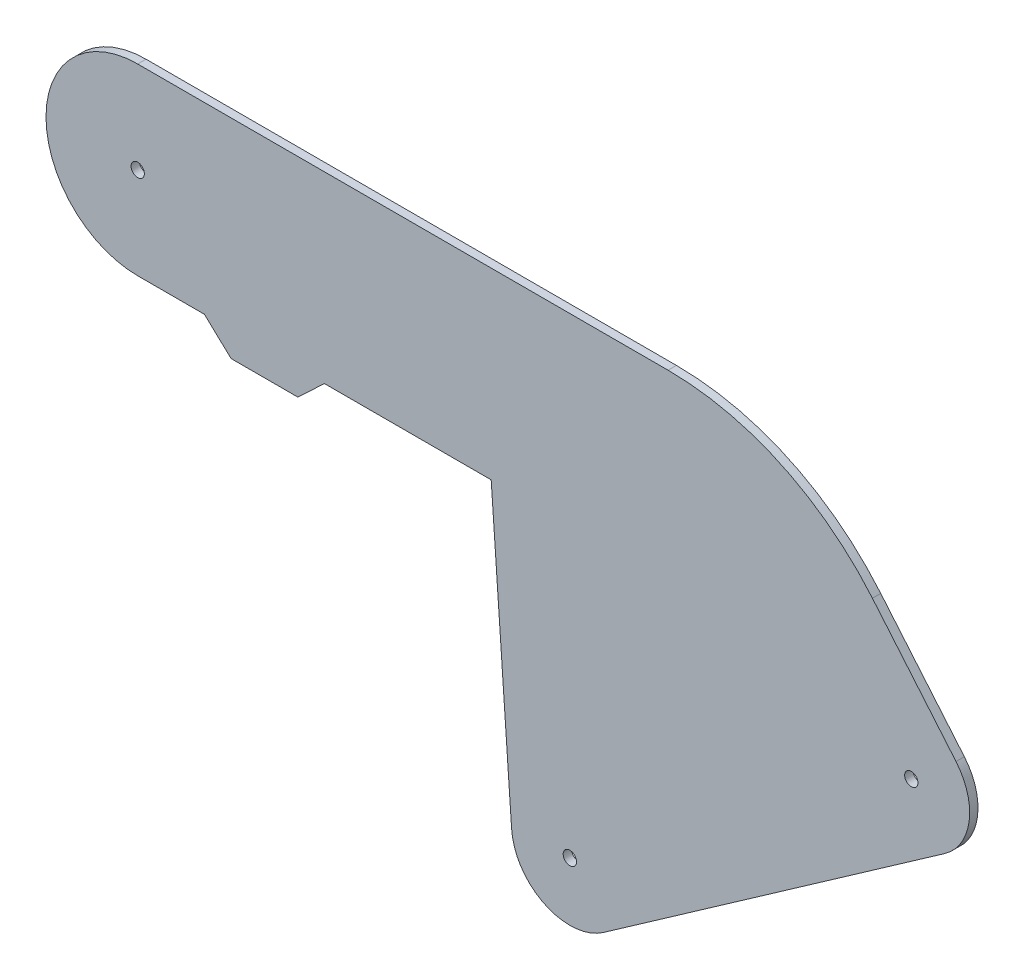
ISO-10303-21;
HEADER;
FILE_DESCRIPTION(('STEP AP214'),'2;1');
FILE_NAME('part.step','',(''),(''),'','','');
FILE_SCHEMA(('AUTOMOTIVE_DESIGN { 1 0 10303 214 1 1 1 1 }'));
ENDSEC;
DATA;
#1=APPLICATION_CONTEXT('core data for automotive mechanical design processes');
#2=APPLICATION_PROTOCOL_DEFINITION('international standard','automotive_design',2000,#1);
#3=PRODUCT_CONTEXT('',#1,'mechanical');
#4=PRODUCT('Part','Part','',(#3));
#5=PRODUCT_RELATED_PRODUCT_CATEGORY('part','',(#4));
#6=PRODUCT_DEFINITION_FORMATION('','',#4);
#7=PRODUCT_DEFINITION_CONTEXT('part definition',#1,'design');
#8=PRODUCT_DEFINITION('design','',#6,#7);
#9=PRODUCT_DEFINITION_SHAPE('','',#8);
#10=(LENGTH_UNIT() NAMED_UNIT(*) SI_UNIT(.MILLI.,.METRE.));
#11=(NAMED_UNIT(*) PLANE_ANGLE_UNIT() SI_UNIT($,.RADIAN.));
#12=(NAMED_UNIT(*) SI_UNIT($,.STERADIAN.) SOLID_ANGLE_UNIT());
#13=UNCERTAINTY_MEASURE_WITH_UNIT(LENGTH_MEASURE(1.E-05),#10,'distance_accuracy_value','');
#14=(GEOMETRIC_REPRESENTATION_CONTEXT(3) GLOBAL_UNCERTAINTY_ASSIGNED_CONTEXT((#13)) GLOBAL_UNIT_ASSIGNED_CONTEXT((#10,
#11,#12)) REPRESENTATION_CONTEXT('',''));
#15=CARTESIAN_POINT('',(0.,0.,0.));
#16=DIRECTION('',(0.,0.,1.));
#17=DIRECTION('',(1.,0.,0.));
#18=AXIS2_PLACEMENT_3D('',#15,#16,#17);
#19=CARTESIAN_POINT('',(164.572072720799,71.2488259804571,3.175));
#20=DIRECTION('',(0.,0.,1.));
#21=DIRECTION('',(1.,0.,0.));
#22=AXIS2_PLACEMENT_3D('',#19,#20,#21);
#23=PLANE('',#22);
#24=CARTESIAN_POINT('',(0.,215.9,3.175));
#25=DIRECTION('',(0.,0.,1.));
#26=DIRECTION('',(1.,0.,0.));
#27=AXIS2_PLACEMENT_3D('',#24,#25,#26);
#28=CIRCLE('',#27,2.54000000000001);
#29=CARTESIAN_POINT('',(2.54000000000001,215.9,3.175));
#30=VERTEX_POINT('',#29);
#31=EDGE_CURVE('E349',#30,#30,#28,.T.);
#32=ORIENTED_EDGE('',*,*,#31,.F.);
#33=EDGE_LOOP('',(#32));
#34=FACE_BOUND('',#33,.T.);
#35=CARTESIAN_POINT('',(164.572072720799,71.2488259804571,3.175));
#36=DIRECTION('',(0.,0.,1.));
#37=DIRECTION('',(1.,0.,0.));
#38=AXIS2_PLACEMENT_3D('',#35,#36,#37);
#39=CIRCLE('',#38,22.225);
#40=CARTESIAN_POINT('',(142.401211703775,69.698488351494,3.175));
#41=VERTEX_POINT('',#40);
#42=CARTESIAN_POINT('',(177.319809018701,53.0431717961343,3.175));
#43=VERTEX_POINT('',#42);
#44=EDGE_CURVE('E215',#41,#43,#39,.T.);
#45=ORIENTED_EDGE('',*,*,#44,.T.);
#46=DIRECTION('',(0.819152044288991,0.573576436351047,0.));
#47=VECTOR('',#46,1.);
#48=CARTESIAN_POINT('',(177.319809018701,53.0431717961343,3.175));
#49=LINE('',#48,#47);
#50=CARTESIAN_POINT('',(307.360196049579,144.098431066863,3.175));
#51=VERTEX_POINT('',#50);
#52=EDGE_CURVE('E121',#43,#51,#49,.T.);
#53=ORIENTED_EDGE('',*,*,#52,.T.);
#54=CARTESIAN_POINT('',(294.612459751677,162.304085251186,3.175));
#55=DIRECTION('',(0.,0.,1.));
#56=DIRECTION('',(-1.,0.,0.));
#57=AXIS2_PLACEMENT_3D('',#54,#55,#56);
#58=CIRCLE('',#57,22.225);
#59=CARTESIAN_POINT('',(311.637797499996,176.590039876469,3.175));
#60=VERTEX_POINT('',#59);
#61=EDGE_CURVE('E256',#51,#60,#58,.T.);
#62=ORIENTED_EDGE('',*,*,#61,.T.);
#63=DIRECTION('',(-0.642787609686537,0.76604444311898,0.));
#64=VECTOR('',#63,1.);
#65=CARTESIAN_POINT('',(279.800527192222,214.532221144152,3.175));
#66=LINE('',#65,#64);
#67=CARTESIAN_POINT('',(279.800527192222,214.532221144152,3.175));
#68=VERTEX_POINT('',#67);
#69=EDGE_CURVE('E276',#60,#68,#66,.T.);
#70=ORIENTED_EDGE('',*,*,#69,.T.);
#71=CARTESIAN_POINT('',(201.970411771333,149.225,3.175));
#72=DIRECTION('',(0.,0.,1.));
#73=DIRECTION('',(-1.,0.,0.));
#74=AXIS2_PLACEMENT_3D('',#71,#72,#73);
#75=CIRCLE('',#74,101.6);
#76=CARTESIAN_POINT('',(201.970411771333,250.825,3.175));
#77=VERTEX_POINT('',#76);
#78=EDGE_CURVE('E272',#68,#77,#75,.T.);
#79=ORIENTED_EDGE('',*,*,#78,.T.);
#80=DIRECTION('',(-1.,0.,0.));
#81=VECTOR('',#80,1.);
#82=CARTESIAN_POINT('',(0.,250.825,3.175));
#83=LINE('',#82,#81);
#84=CARTESIAN_POINT('',(0.,250.825,3.175));
#85=VERTEX_POINT('',#84);
#86=EDGE_CURVE('E275',#77,#85,#83,.T.);
#87=ORIENTED_EDGE('',*,*,#86,.T.);
#88=CARTESIAN_POINT('',(0.,215.9,3.175));
#89=DIRECTION('',(0.,0.,1.));
#90=DIRECTION('',(1.,0.,0.));
#91=AXIS2_PLACEMENT_3D('',#88,#89,#90);
#92=CIRCLE('',#91,34.925);
#93=CARTESIAN_POINT('',(0.,180.975,3.175));
#94=VERTEX_POINT('',#93);
#95=EDGE_CURVE('E280',#85,#94,#92,.T.);
#96=ORIENTED_EDGE('',*,*,#95,.T.);
#97=DIRECTION('',(1.,0.,0.));
#98=VECTOR('',#97,1.);
#99=CARTESIAN_POINT('',(0.,180.975,3.175));
#100=LINE('',#99,#98);
#101=CARTESIAN_POINT('',(25.4,180.975,3.175));
#102=VERTEX_POINT('',#101);
#103=EDGE_CURVE('E287',#94,#102,#100,.T.);
#104=ORIENTED_EDGE('',*,*,#103,.T.);
#105=DIRECTION('',(0.729537204140085,-0.68394112888133,0.));
#106=VECTOR('',#105,1.);
#107=CARTESIAN_POINT('',(25.4,180.975,3.175));
#108=LINE('',#107,#106);
#109=CARTESIAN_POINT('',(35.56,171.45,3.175));
#110=VERTEX_POINT('',#109);
#111=EDGE_CURVE('E290',#102,#110,#108,.T.);
#112=ORIENTED_EDGE('',*,*,#111,.T.);
#113=DIRECTION('',(1.,0.,0.));
#114=VECTOR('',#113,1.);
#115=CARTESIAN_POINT('',(35.56,171.45,3.175));
#116=LINE('',#115,#114);
#117=CARTESIAN_POINT('',(60.96,171.45,3.175));
#118=VERTEX_POINT('',#117);
#119=EDGE_CURVE('E155',#110,#118,#116,.T.);
#120=ORIENTED_EDGE('',*,*,#119,.T.);
#121=DIRECTION('',(0.729537204140086,0.683941128881329,0.));
#122=VECTOR('',#121,1.);
#123=CARTESIAN_POINT('',(60.96,171.45,3.175));
#124=LINE('',#123,#122);
#125=CARTESIAN_POINT('',(71.12,180.975,3.175));
#126=VERTEX_POINT('',#125);
#127=EDGE_CURVE('E149',#118,#126,#124,.T.);
#128=ORIENTED_EDGE('',*,*,#127,.T.);
#129=DIRECTION('',(1.,0.,0.));
#130=VECTOR('',#129,1.);
#131=CARTESIAN_POINT('',(71.12,180.975,3.175));
#132=LINE('',#131,#130);
#133=CARTESIAN_POINT('',(134.62,180.975,3.175));
#134=VERTEX_POINT('',#133);
#135=EDGE_CURVE('E153',#126,#134,#132,.T.);
#136=ORIENTED_EDGE('',*,*,#135,.T.);
#137=DIRECTION('',(0.0697564737441218,-0.997564050259824,0.));
#138=VECTOR('',#137,1.);
#139=CARTESIAN_POINT('',(134.62,180.975,3.175));
#140=LINE('',#139,#138);
#141=EDGE_CURVE('E63',#134,#41,#140,.T.);
#142=ORIENTED_EDGE('',*,*,#141,.T.);
#143=EDGE_LOOP('',(#45,#53,#62,#70,#79,#87,#96,#104,#112,#120,#128,#136,#142));
#144=FACE_BOUND('',#143,.T.);
#145=CARTESIAN_POINT('',(164.572072720799,71.2488259804571,3.175));
#146=DIRECTION('',(0.,0.,1.));
#147=DIRECTION('',(1.,0.,0.));
#148=AXIS2_PLACEMENT_3D('',#145,#146,#147);
#149=CIRCLE('',#148,2.5400000000398);
#150=CARTESIAN_POINT('',(167.112072720839,71.2488259804571,3.175));
#151=VERTEX_POINT('',#150);
#152=EDGE_CURVE('E182',#151,#151,#149,.T.);
#153=ORIENTED_EDGE('',*,*,#152,.F.);
#154=EDGE_LOOP('',(#153));
#155=FACE_BOUND('',#154,.T.);
#156=CARTESIAN_POINT('',(294.612459751677,162.304085251186,3.175));
#157=DIRECTION('',(0.,0.,1.));
#158=DIRECTION('',(1.,0.,0.));
#159=AXIS2_PLACEMENT_3D('',#156,#157,#158);
#160=CIRCLE('',#159,2.54000000000186);
#161=CARTESIAN_POINT('',(297.152459751678,162.304085251186,3.175));
#162=VERTEX_POINT('',#161);
#163=EDGE_CURVE('E338',#162,#162,#160,.T.);
#164=ORIENTED_EDGE('',*,*,#163,.F.);
#165=EDGE_LOOP('',(#164));
#166=FACE_BOUND('',#165,.T.);
#167=ADVANCED_FACE('F45',(#34,#144,#155,#166),#23,.T.);
#168=CARTESIAN_POINT('',(164.572072720799,71.2488259804571,0.));
#169=DIRECTION('',(0.,0.,1.));
#170=DIRECTION('',(1.,0.,0.));
#171=AXIS2_PLACEMENT_3D('',#168,#169,#170);
#172=PLANE('',#171);
#173=CARTESIAN_POINT('',(164.572072720799,71.2488259804571,0.));
#174=DIRECTION('',(0.,0.,1.));
#175=DIRECTION('',(1.,0.,0.));
#176=AXIS2_PLACEMENT_3D('',#173,#174,#175);
#177=CIRCLE('',#176,22.225);
#178=CARTESIAN_POINT('',(142.401211703775,69.698488351494,0.));
#179=VERTEX_POINT('',#178);
#180=CARTESIAN_POINT('',(177.319809018701,53.0431717961343,0.));
#181=VERTEX_POINT('',#180);
#182=EDGE_CURVE('E177',#179,#181,#177,.T.);
#183=ORIENTED_EDGE('',*,*,#182,.F.);
#184=DIRECTION('',(0.0697564737441218,-0.997564050259824,0.));
#185=VECTOR('',#184,1.);
#186=CARTESIAN_POINT('',(134.62,180.975,0.));
#187=LINE('',#186,#185);
#188=CARTESIAN_POINT('',(134.62,180.975,0.));
#189=VERTEX_POINT('',#188);
#190=EDGE_CURVE('E113',#189,#179,#187,.T.);
#191=ORIENTED_EDGE('',*,*,#190,.F.);
#192=DIRECTION('',(1.,0.,0.));
#193=VECTOR('',#192,1.);
#194=CARTESIAN_POINT('',(71.12,180.975,0.));
#195=LINE('',#194,#193);
#196=CARTESIAN_POINT('',(71.12,180.975,0.));
#197=VERTEX_POINT('',#196);
#198=EDGE_CURVE('E107',#197,#189,#195,.T.);
#199=ORIENTED_EDGE('',*,*,#198,.F.);
#200=DIRECTION('',(0.729537204140086,0.683941128881329,0.));
#201=VECTOR('',#200,1.);
#202=CARTESIAN_POINT('',(60.96,171.45,0.));
#203=LINE('',#202,#201);
#204=CARTESIAN_POINT('',(60.96,171.45,0.));
#205=VERTEX_POINT('',#204);
#206=EDGE_CURVE('E164',#205,#197,#203,.T.);
#207=ORIENTED_EDGE('',*,*,#206,.F.);
#208=DIRECTION('',(1.,0.,0.));
#209=VECTOR('',#208,1.);
#210=CARTESIAN_POINT('',(35.56,171.45,0.));
#211=LINE('',#210,#209);
#212=CARTESIAN_POINT('',(35.56,171.45,0.));
#213=VERTEX_POINT('',#212);
#214=EDGE_CURVE('E206',#213,#205,#211,.T.);
#215=ORIENTED_EDGE('',*,*,#214,.F.);
#216=DIRECTION('',(0.729537204140085,-0.68394112888133,0.));
#217=VECTOR('',#216,1.);
#218=CARTESIAN_POINT('',(25.4,180.975,0.));
#219=LINE('',#218,#217);
#220=CARTESIAN_POINT('',(25.4,180.975,0.));
#221=VERTEX_POINT('',#220);
#222=EDGE_CURVE('E203',#221,#213,#219,.T.);
#223=ORIENTED_EDGE('',*,*,#222,.F.);
#224=DIRECTION('',(1.,0.,0.));
#225=VECTOR('',#224,1.);
#226=CARTESIAN_POINT('',(0.,180.975,0.));
#227=LINE('',#226,#225);
#228=CARTESIAN_POINT('',(0.,180.975,0.));
#229=VERTEX_POINT('',#228);
#230=EDGE_CURVE('E200',#229,#221,#227,.T.);
#231=ORIENTED_EDGE('',*,*,#230,.F.);
#232=CARTESIAN_POINT('',(0.,215.9,0.));
#233=DIRECTION('',(0.,0.,1.));
#234=DIRECTION('',(1.,0.,0.));
#235=AXIS2_PLACEMENT_3D('',#232,#233,#234);
#236=CIRCLE('',#235,34.925);
#237=CARTESIAN_POINT('',(0.,250.825,0.));
#238=VERTEX_POINT('',#237);
#239=EDGE_CURVE('E197',#238,#229,#236,.T.);
#240=ORIENTED_EDGE('',*,*,#239,.F.);
#241=DIRECTION('',(-1.,0.,0.));
#242=VECTOR('',#241,1.);
#243=CARTESIAN_POINT('',(0.,250.825,0.));
#244=LINE('',#243,#242);
#245=CARTESIAN_POINT('',(201.970411771333,250.825,0.));
#246=VERTEX_POINT('',#245);
#247=EDGE_CURVE('E194',#246,#238,#244,.T.);
#248=ORIENTED_EDGE('',*,*,#247,.F.);
#249=CARTESIAN_POINT('',(201.970411771333,149.225,0.));
#250=DIRECTION('',(0.,0.,1.));
#251=DIRECTION('',(-1.,0.,0.));
#252=AXIS2_PLACEMENT_3D('',#249,#250,#251);
#253=CIRCLE('',#252,101.6);
#254=CARTESIAN_POINT('',(279.800527192222,214.532221144152,0.));
#255=VERTEX_POINT('',#254);
#256=EDGE_CURVE('E191',#255,#246,#253,.T.);
#257=ORIENTED_EDGE('',*,*,#256,.F.);
#258=DIRECTION('',(-0.642787609686537,0.76604444311898,0.));
#259=VECTOR('',#258,1.);
#260=CARTESIAN_POINT('',(279.800527192222,214.532221144152,0.));
#261=LINE('',#260,#259);
#262=CARTESIAN_POINT('',(311.637797499996,176.590039876469,0.));
#263=VERTEX_POINT('',#262);
#264=EDGE_CURVE('E188',#263,#255,#261,.T.);
#265=ORIENTED_EDGE('',*,*,#264,.F.);
#266=CARTESIAN_POINT('',(294.612459751677,162.304085251186,0.));
#267=DIRECTION('',(0.,0.,1.));
#268=DIRECTION('',(-1.,0.,0.));
#269=AXIS2_PLACEMENT_3D('',#266,#267,#268);
#270=CIRCLE('',#269,22.225);
#271=CARTESIAN_POINT('',(307.360196049579,144.098431066863,0.));
#272=VERTEX_POINT('',#271);
#273=EDGE_CURVE('E185',#272,#263,#270,.T.);
#274=ORIENTED_EDGE('',*,*,#273,.F.);
#275=DIRECTION('',(0.819152044288991,0.573576436351047,0.));
#276=VECTOR('',#275,1.);
#277=CARTESIAN_POINT('',(177.319809018701,53.0431717961343,0.));
#278=LINE('',#277,#276);
#279=EDGE_CURVE('E181',#181,#272,#278,.T.);
#280=ORIENTED_EDGE('',*,*,#279,.F.);
#281=EDGE_LOOP('',(#183,#191,#199,#207,#215,#223,#231,#240,#248,#257,#265,#274,#280));
#282=FACE_BOUND('',#281,.T.);
#283=CARTESIAN_POINT('',(164.572072720799,71.2488259804571,0.));
#284=DIRECTION('',(0.,0.,1.));
#285=DIRECTION('',(1.,0.,0.));
#286=AXIS2_PLACEMENT_3D('',#283,#284,#285);
#287=CIRCLE('',#286,2.5400000000398);
#288=CARTESIAN_POINT('',(167.112072720839,71.2488259804571,0.));
#289=VERTEX_POINT('',#288);
#290=EDGE_CURVE('E353',#289,#289,#287,.T.);
#291=ORIENTED_EDGE('',*,*,#290,.T.);
#292=EDGE_LOOP('',(#291));
#293=FACE_BOUND('',#292,.T.);
#294=CARTESIAN_POINT('',(0.,215.9,0.));
#295=DIRECTION('',(0.,0.,1.));
#296=DIRECTION('',(1.,0.,0.));
#297=AXIS2_PLACEMENT_3D('',#294,#295,#296);
#298=CIRCLE('',#297,2.54000000000001);
#299=CARTESIAN_POINT('',(2.54000000000001,215.9,0.));
#300=VERTEX_POINT('',#299);
#301=EDGE_CURVE('E346',#300,#300,#298,.T.);
#302=ORIENTED_EDGE('',*,*,#301,.T.);
#303=EDGE_LOOP('',(#302));
#304=FACE_BOUND('',#303,.T.);
#305=CARTESIAN_POINT('',(294.612459751677,162.304085251186,0.));
#306=DIRECTION('',(0.,0.,1.));
#307=DIRECTION('',(1.,0.,0.));
#308=AXIS2_PLACEMENT_3D('',#305,#306,#307);
#309=CIRCLE('',#308,2.54000000000186);
#310=CARTESIAN_POINT('',(297.152459751678,162.304085251186,0.));
#311=VERTEX_POINT('',#310);
#312=EDGE_CURVE('E341',#311,#311,#309,.T.);
#313=ORIENTED_EDGE('',*,*,#312,.T.);
#314=EDGE_LOOP('',(#313));
#315=FACE_BOUND('',#314,.T.);
#316=ADVANCED_FACE('F260',(#282,#293,#304,#315),#172,.F.);
#317=CARTESIAN_POINT('',(164.572072720799,71.2488259804571,3.175));
#318=DIRECTION('',(0.,0.,-1.));
#319=DIRECTION('',(-1.,0.,0.));
#320=AXIS2_PLACEMENT_3D('',#317,#318,#319);
#321=CYLINDRICAL_SURFACE('',#320,22.225);
#322=ORIENTED_EDGE('',*,*,#182,.T.);
#323=DIRECTION('',(0.,0.,-1.));
#324=VECTOR('',#323,1.);
#325=CARTESIAN_POINT('',(177.319809018701,53.0431717961343,3.175));
#326=LINE('',#325,#324);
#327=EDGE_CURVE('E11',#43,#181,#326,.T.);
#328=ORIENTED_EDGE('',*,*,#327,.F.);
#329=ORIENTED_EDGE('',*,*,#44,.F.);
#330=DIRECTION('',(0.,0.,-1.));
#331=VECTOR('',#330,1.);
#332=CARTESIAN_POINT('',(142.401211703775,69.698488351494,3.175));
#333=LINE('',#332,#331);
#334=EDGE_CURVE('E173',#41,#179,#333,.T.);
#335=ORIENTED_EDGE('',*,*,#334,.T.);
#336=EDGE_LOOP('',(#322,#328,#329,#335));
#337=FACE_BOUND('',#336,.T.);
#338=ADVANCED_FACE('F47',(#337),#321,.T.);
#339=CARTESIAN_POINT('',(177.319809018701,53.0431717961343,3.175));
#340=DIRECTION('',(-0.573576436351047,0.819152044288991,0.));
#341=DIRECTION('',(-0.819152044288991,-0.573576436351047,0.));
#342=AXIS2_PLACEMENT_3D('',#339,#340,#341);
#343=PLANE('',#342);
#344=ORIENTED_EDGE('',*,*,#279,.T.);
#345=DIRECTION('',(0.,0.,-1.));
#346=VECTOR('',#345,1.);
#347=CARTESIAN_POINT('',(307.360196049579,144.098431066863,3.175));
#348=LINE('',#347,#346);
#349=EDGE_CURVE('E55',#51,#272,#348,.T.);
#350=ORIENTED_EDGE('',*,*,#349,.F.);
#351=ORIENTED_EDGE('',*,*,#52,.F.);
#352=ORIENTED_EDGE('',*,*,#327,.T.);
#353=EDGE_LOOP('',(#344,#350,#351,#352));
#354=FACE_BOUND('',#353,.T.);
#355=ADVANCED_FACE('F474',(#354),#343,.F.);
#356=CARTESIAN_POINT('',(294.612459751677,162.304085251186,3.175));
#357=DIRECTION('',(0.,0.,-1.));
#358=DIRECTION('',(-1.,0.,0.));
#359=AXIS2_PLACEMENT_3D('',#356,#357,#358);
#360=CYLINDRICAL_SURFACE('',#359,22.225);
#361=ORIENTED_EDGE('',*,*,#273,.T.);
#362=DIRECTION('',(0.,0.,-1.));
#363=VECTOR('',#362,1.);
#364=CARTESIAN_POINT('',(311.637797499996,176.590039876469,3.175));
#365=LINE('',#364,#363);
#366=EDGE_CURVE('E246',#60,#263,#365,.T.);
#367=ORIENTED_EDGE('',*,*,#366,.F.);
#368=ORIENTED_EDGE('',*,*,#61,.F.);
#369=ORIENTED_EDGE('',*,*,#349,.T.);
#370=EDGE_LOOP('',(#361,#367,#368,#369));
#371=FACE_BOUND('',#370,.T.);
#372=ADVANCED_FACE('F254',(#371),#360,.T.);
#373=CARTESIAN_POINT('',(279.800527192222,214.532221144152,3.175));
#374=DIRECTION('',(-0.76604444311898,-0.642787609686537,0.));
#375=DIRECTION('',(0.642787609686537,-0.76604444311898,0.));
#376=AXIS2_PLACEMENT_3D('',#373,#374,#375);
#377=PLANE('',#376);
#378=ORIENTED_EDGE('',*,*,#264,.T.);
#379=DIRECTION('',(0.,0.,-1.));
#380=VECTOR('',#379,1.);
#381=CARTESIAN_POINT('',(279.800527192222,214.532221144152,3.175));
#382=LINE('',#381,#380);
#383=EDGE_CURVE('E242',#68,#255,#382,.T.);
#384=ORIENTED_EDGE('',*,*,#383,.F.);
#385=ORIENTED_EDGE('',*,*,#69,.F.);
#386=ORIENTED_EDGE('',*,*,#366,.T.);
#387=EDGE_LOOP('',(#378,#384,#385,#386));
#388=FACE_BOUND('',#387,.T.);
#389=ADVANCED_FACE('F266',(#388),#377,.F.);
#390=CARTESIAN_POINT('',(201.970411771333,149.225,3.175));
#391=DIRECTION('',(0.,0.,-1.));
#392=DIRECTION('',(-1.,0.,0.));
#393=AXIS2_PLACEMENT_3D('',#390,#391,#392);
#394=CYLINDRICAL_SURFACE('',#393,101.6);
#395=ORIENTED_EDGE('',*,*,#256,.T.);
#396=DIRECTION('',(0.,0.,-1.));
#397=VECTOR('',#396,1.);
#398=CARTESIAN_POINT('',(201.970411771333,250.825,3.175));
#399=LINE('',#398,#397);
#400=EDGE_CURVE('E238',#77,#246,#399,.T.);
#401=ORIENTED_EDGE('',*,*,#400,.F.);
#402=ORIENTED_EDGE('',*,*,#78,.F.);
#403=ORIENTED_EDGE('',*,*,#383,.T.);
#404=EDGE_LOOP('',(#395,#401,#402,#403));
#405=FACE_BOUND('',#404,.T.);
#406=ADVANCED_FACE('F270',(#405),#394,.T.);
#407=CARTESIAN_POINT('',(0.,250.825,3.175));
#408=DIRECTION('',(0.,-1.,0.));
#409=DIRECTION('',(1.,0.,0.));
#410=AXIS2_PLACEMENT_3D('',#407,#408,#409);
#411=PLANE('',#410);
#412=ORIENTED_EDGE('',*,*,#247,.T.);
#413=DIRECTION('',(0.,0.,-1.));
#414=VECTOR('',#413,1.);
#415=CARTESIAN_POINT('',(0.,250.825,3.175));
#416=LINE('',#415,#414);
#417=EDGE_CURVE('E234',#85,#238,#416,.T.);
#418=ORIENTED_EDGE('',*,*,#417,.F.);
#419=ORIENTED_EDGE('',*,*,#86,.F.);
#420=ORIENTED_EDGE('',*,*,#400,.T.);
#421=EDGE_LOOP('',(#412,#418,#419,#420));
#422=FACE_BOUND('',#421,.T.);
#423=ADVANCED_FACE('F439',(#422),#411,.F.);
#424=CARTESIAN_POINT('',(0.,215.9,3.175));
#425=DIRECTION('',(0.,0.,-1.));
#426=DIRECTION('',(-1.,0.,0.));
#427=AXIS2_PLACEMENT_3D('',#424,#425,#426);
#428=CYLINDRICAL_SURFACE('',#427,34.925);
#429=ORIENTED_EDGE('',*,*,#239,.T.);
#430=DIRECTION('',(0.,0.,-1.));
#431=VECTOR('',#430,1.);
#432=CARTESIAN_POINT('',(0.,180.975,3.175));
#433=LINE('',#432,#431);
#434=EDGE_CURVE('E230',#94,#229,#433,.T.);
#435=ORIENTED_EDGE('',*,*,#434,.F.);
#436=ORIENTED_EDGE('',*,*,#95,.F.);
#437=ORIENTED_EDGE('',*,*,#417,.T.);
#438=EDGE_LOOP('',(#429,#435,#436,#437));
#439=FACE_BOUND('',#438,.T.);
#440=ADVANCED_FACE('F429',(#439),#428,.T.);
#441=CARTESIAN_POINT('',(0.,180.975,3.175));
#442=DIRECTION('',(0.,1.,0.));
#443=DIRECTION('',(-1.,0.,0.));
#444=AXIS2_PLACEMENT_3D('',#441,#442,#443);
#445=PLANE('',#444);
#446=ORIENTED_EDGE('',*,*,#230,.T.);
#447=DIRECTION('',(0.,0.,-1.));
#448=VECTOR('',#447,1.);
#449=CARTESIAN_POINT('',(25.4,180.975,3.175));
#450=LINE('',#449,#448);
#451=EDGE_CURVE('E226',#102,#221,#450,.T.);
#452=ORIENTED_EDGE('',*,*,#451,.F.);
#453=ORIENTED_EDGE('',*,*,#103,.F.);
#454=ORIENTED_EDGE('',*,*,#434,.T.);
#455=EDGE_LOOP('',(#446,#452,#453,#454));
#456=FACE_BOUND('',#455,.T.);
#457=ADVANCED_FACE('F420',(#456),#445,.F.);
#458=CARTESIAN_POINT('',(25.4,180.975,3.175));
#459=DIRECTION('',(0.68394112888133,0.729537204140085,0.));
#460=DIRECTION('',(-0.729537204140085,0.68394112888133,0.));
#461=AXIS2_PLACEMENT_3D('',#458,#459,#460);
#462=PLANE('',#461);
#463=ORIENTED_EDGE('',*,*,#222,.T.);
#464=DIRECTION('',(0.,0.,-1.));
#465=VECTOR('',#464,1.);
#466=CARTESIAN_POINT('',(35.56,171.45,3.175));
#467=LINE('',#466,#465);
#468=EDGE_CURVE('E222',#110,#213,#467,.T.);
#469=ORIENTED_EDGE('',*,*,#468,.F.);
#470=ORIENTED_EDGE('',*,*,#111,.F.);
#471=ORIENTED_EDGE('',*,*,#451,.T.);
#472=EDGE_LOOP('',(#463,#469,#470,#471));
#473=FACE_BOUND('',#472,.T.);
#474=ADVANCED_FACE('F298',(#473),#462,.F.);
#475=CARTESIAN_POINT('',(35.56,171.45,3.175));
#476=DIRECTION('',(0.,1.,0.));
#477=DIRECTION('',(0.,0.,1.));
#478=AXIS2_PLACEMENT_3D('',#475,#476,#477);
#479=PLANE('',#478);
#480=ORIENTED_EDGE('',*,*,#214,.T.);
#481=DIRECTION('',(0.,0.,-1.));
#482=VECTOR('',#481,1.);
#483=CARTESIAN_POINT('',(60.96,171.45,3.175));
#484=LINE('',#483,#482);
#485=EDGE_CURVE('E166',#118,#205,#484,.T.);
#486=ORIENTED_EDGE('',*,*,#485,.F.);
#487=ORIENTED_EDGE('',*,*,#119,.F.);
#488=ORIENTED_EDGE('',*,*,#468,.T.);
#489=EDGE_LOOP('',(#480,#486,#487,#488));
#490=FACE_BOUND('',#489,.T.);
#491=ADVANCED_FACE('F302',(#490),#479,.F.);
#492=CARTESIAN_POINT('',(60.96,171.45,3.175));
#493=DIRECTION('',(-0.683941128881329,0.729537204140086,0.));
#494=DIRECTION('',(-0.729537204140086,-0.683941128881329,0.));
#495=AXIS2_PLACEMENT_3D('',#492,#493,#494);
#496=PLANE('',#495);
#497=ORIENTED_EDGE('',*,*,#206,.T.);
#498=DIRECTION('',(0.,0.,-1.));
#499=VECTOR('',#498,1.);
#500=CARTESIAN_POINT('',(71.12,180.975,3.175));
#501=LINE('',#500,#499);
#502=EDGE_CURVE('E161',#126,#197,#501,.T.);
#503=ORIENTED_EDGE('',*,*,#502,.F.);
#504=ORIENTED_EDGE('',*,*,#127,.F.);
#505=ORIENTED_EDGE('',*,*,#485,.T.);
#506=EDGE_LOOP('',(#497,#503,#504,#505));
#507=FACE_BOUND('',#506,.T.);
#508=ADVANCED_FACE('F162',(#507),#496,.F.);
#509=CARTESIAN_POINT('',(71.12,180.975,3.175));
#510=DIRECTION('',(0.,1.,0.));
#511=DIRECTION('',(-1.,0.,0.));
#512=AXIS2_PLACEMENT_3D('',#509,#510,#511);
#513=PLANE('',#512);
#514=ORIENTED_EDGE('',*,*,#198,.T.);
#515=DIRECTION('',(0.,0.,-1.));
#516=VECTOR('',#515,1.);
#517=CARTESIAN_POINT('',(134.62,180.975,3.175));
#518=LINE('',#517,#516);
#519=EDGE_CURVE('E167',#134,#189,#518,.T.);
#520=ORIENTED_EDGE('',*,*,#519,.F.);
#521=ORIENTED_EDGE('',*,*,#135,.F.);
#522=ORIENTED_EDGE('',*,*,#502,.T.);
#523=EDGE_LOOP('',(#514,#520,#521,#522));
#524=FACE_BOUND('',#523,.T.);
#525=ADVANCED_FACE('F169',(#524),#513,.F.);
#526=CARTESIAN_POINT('',(134.62,180.975,3.175));
#527=DIRECTION('',(0.997564050259825,0.0697564737441218,0.));
#528=DIRECTION('',(-0.0697564737441218,0.997564050259825,0.));
#529=AXIS2_PLACEMENT_3D('',#526,#527,#528);
#530=PLANE('',#529);
#531=ORIENTED_EDGE('',*,*,#190,.T.);
#532=ORIENTED_EDGE('',*,*,#334,.F.);
#533=ORIENTED_EDGE('',*,*,#141,.F.);
#534=ORIENTED_EDGE('',*,*,#519,.T.);
#535=EDGE_LOOP('',(#531,#532,#533,#534));
#536=FACE_BOUND('',#535,.T.);
#537=ADVANCED_FACE('F306',(#536),#530,.F.);
#538=CARTESIAN_POINT('',(164.572072720799,71.2488259804571,3.175));
#539=DIRECTION('',(0.,0.,-1.));
#540=DIRECTION('',(-1.,0.,0.));
#541=AXIS2_PLACEMENT_3D('',#538,#539,#540);
#542=CYLINDRICAL_SURFACE('',#541,2.5400000000398);
#543=ORIENTED_EDGE('',*,*,#152,.T.);
#544=EDGE_LOOP('',(#543));
#545=FACE_BOUND('',#544,.T.);
#546=ORIENTED_EDGE('',*,*,#290,.F.);
#547=EDGE_LOOP('',(#546));
#548=FACE_BOUND('',#547,.T.);
#549=ADVANCED_FACE('F308',(#545,#548),#542,.F.);
#550=CARTESIAN_POINT('',(0.,215.9,3.175));
#551=DIRECTION('',(0.,0.,-1.));
#552=DIRECTION('',(-1.,0.,0.));
#553=AXIS2_PLACEMENT_3D('',#550,#551,#552);
#554=CYLINDRICAL_SURFACE('',#553,2.54000000000001);
#555=ORIENTED_EDGE('',*,*,#31,.T.);
#556=EDGE_LOOP('',(#555));
#557=FACE_BOUND('',#556,.T.);
#558=ORIENTED_EDGE('',*,*,#301,.F.);
#559=EDGE_LOOP('',(#558));
#560=FACE_BOUND('',#559,.T.);
#561=ADVANCED_FACE('F314',(#557,#560),#554,.F.);
#562=CARTESIAN_POINT('',(294.612459751677,162.304085251186,3.175));
#563=DIRECTION('',(0.,0.,-1.));
#564=DIRECTION('',(-1.,0.,0.));
#565=AXIS2_PLACEMENT_3D('',#562,#563,#564);
#566=CYLINDRICAL_SURFACE('',#565,2.54000000000186);
#567=ORIENTED_EDGE('',*,*,#163,.T.);
#568=EDGE_LOOP('',(#567));
#569=FACE_BOUND('',#568,.T.);
#570=ORIENTED_EDGE('',*,*,#312,.F.);
#571=EDGE_LOOP('',(#570));
#572=FACE_BOUND('',#571,.T.);
#573=ADVANCED_FACE('F329',(#569,#572),#566,.F.);
#574=CLOSED_SHELL('',(#167,#316,#338,#355,#372,#389,#406,#423,#440,#457,#474,#491,#508,#525,
#537,#549,#561,#573));
#575=MANIFOLD_SOLID_BREP('B2',#574);
#576=ADVANCED_BREP_SHAPE_REPRESENTATION('',(#18,#575),#14);
#577=SHAPE_DEFINITION_REPRESENTATION(#9,#576);
ENDSEC;
END-ISO-10303-21;
